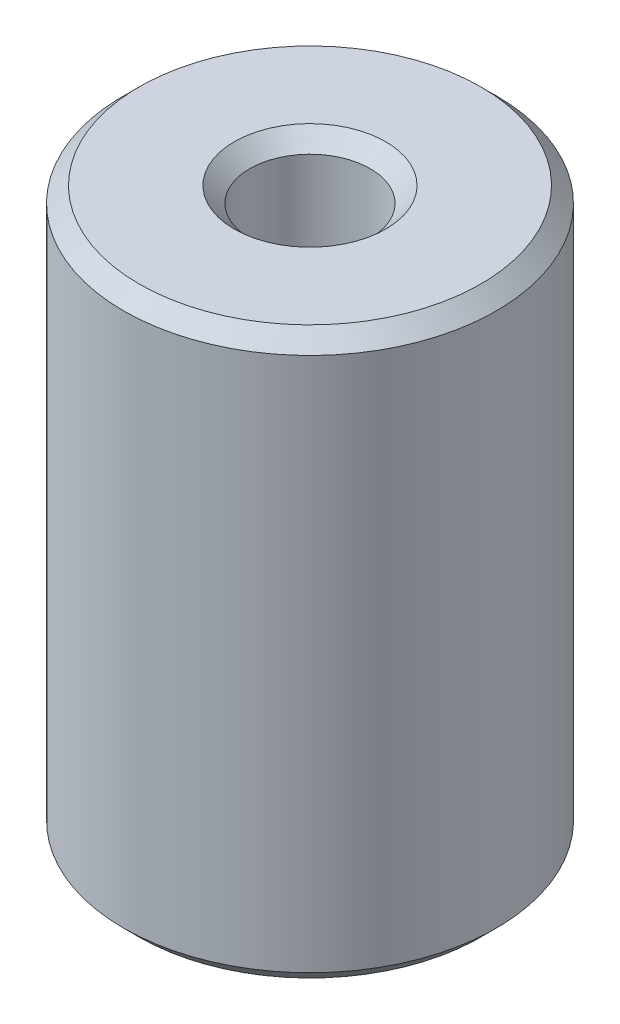
ISO-10303-21;
HEADER;
FILE_DESCRIPTION(('STEP AP214'),'2;1');
FILE_NAME('part.step','',(''),(''),'','','');
FILE_SCHEMA(('AUTOMOTIVE_DESIGN { 1 0 10303 214 1 1 1 1 }'));
ENDSEC;
DATA;
#1=APPLICATION_CONTEXT('core data for automotive mechanical design processes');
#2=APPLICATION_PROTOCOL_DEFINITION('international standard','automotive_design',2000,#1);
#3=PRODUCT_CONTEXT('',#1,'mechanical');
#4=PRODUCT('Part','Part','',(#3));
#5=PRODUCT_RELATED_PRODUCT_CATEGORY('part','',(#4));
#6=PRODUCT_DEFINITION_FORMATION('','',#4);
#7=PRODUCT_DEFINITION_CONTEXT('part definition',#1,'design');
#8=PRODUCT_DEFINITION('design','',#6,#7);
#9=PRODUCT_DEFINITION_SHAPE('','',#8);
#10=(LENGTH_UNIT() NAMED_UNIT(*) SI_UNIT(.MILLI.,.METRE.));
#11=(NAMED_UNIT(*) PLANE_ANGLE_UNIT() SI_UNIT($,.RADIAN.));
#12=(NAMED_UNIT(*) SI_UNIT($,.STERADIAN.) SOLID_ANGLE_UNIT());
#13=UNCERTAINTY_MEASURE_WITH_UNIT(LENGTH_MEASURE(1.E-05),#10,'distance_accuracy_value','');
#14=(GEOMETRIC_REPRESENTATION_CONTEXT(3) GLOBAL_UNCERTAINTY_ASSIGNED_CONTEXT((#13)) GLOBAL_UNIT_ASSIGNED_CONTEXT((#10,
#11,#12)) REPRESENTATION_CONTEXT('',''));
#15=CARTESIAN_POINT('',(0.,0.,0.));
#16=DIRECTION('',(0.,0.,1.));
#17=DIRECTION('',(1.,0.,0.));
#18=AXIS2_PLACEMENT_3D('',#15,#16,#17);
#19=CARTESIAN_POINT('',(0.,15.1792217421074,0.));
#20=DIRECTION('',(0.,-1.,0.));
#21=DIRECTION('',(0.,0.,-1.));
#22=AXIS2_PLACEMENT_3D('',#19,#20,#21);
#23=CYLINDRICAL_SURFACE('',#22,5.);
#24=CARTESIAN_POINT('',(0.,0.416594561890393,0.));
#25=DIRECTION('',(0.,1.,0.));
#26=DIRECTION('',(0.,0.,1.));
#27=AXIS2_PLACEMENT_3D('',#24,#25,#26);
#28=CIRCLE('',#27,5.);
#29=CARTESIAN_POINT('',(0.,0.416594561890393,5.));
#30=VERTEX_POINT('',#29);
#31=EDGE_CURVE('E10',#30,#30,#28,.T.);
#32=ORIENTED_EDGE('',*,*,#31,.T.);
#33=EDGE_LOOP('',(#32));
#34=FACE_BOUND('',#33,.T.);
#35=CARTESIAN_POINT('',(0.,14.762627180217,0.));
#36=DIRECTION('',(0.,1.,0.));
#37=DIRECTION('',(0.,0.,1.));
#38=AXIS2_PLACEMENT_3D('',#35,#36,#37);
#39=CIRCLE('',#38,5.);
#40=CARTESIAN_POINT('',(0.,14.762627180217,5.));
#41=VERTEX_POINT('',#40);
#42=EDGE_CURVE('E50',#41,#41,#39,.F.);
#43=ORIENTED_EDGE('',*,*,#42,.T.);
#44=EDGE_LOOP('',(#43));
#45=FACE_BOUND('',#44,.T.);
#46=ADVANCED_FACE('F39',(#34,#45),#23,.T.);
#47=CARTESIAN_POINT('',(0.,15.1792217421074,0.));
#48=DIRECTION('',(0.,1.,0.));
#49=DIRECTION('',(0.,0.,1.));
#50=AXIS2_PLACEMENT_3D('',#47,#48,#49);
#51=PLANE('',#50);
#52=CARTESIAN_POINT('',(0.,15.1792217421074,0.));
#53=DIRECTION('',(0.,1.,0.));
#54=DIRECTION('',(0.,0.,1.));
#55=AXIS2_PLACEMENT_3D('',#52,#53,#54);
#56=CIRCLE('',#55,2.03197839512757);
#57=CARTESIAN_POINT('',(0.,15.1792217421074,2.03197839512757));
#58=VERTEX_POINT('',#57);
#59=EDGE_CURVE('E58',#58,#58,#56,.F.);
#60=ORIENTED_EDGE('',*,*,#59,.T.);
#61=EDGE_LOOP('',(#60));
#62=FACE_BOUND('',#61,.T.);
#63=CARTESIAN_POINT('',(0.,15.1792217421074,0.));
#64=DIRECTION('',(0.,1.,0.));
#65=DIRECTION('',(0.,0.,1.));
#66=AXIS2_PLACEMENT_3D('',#63,#64,#65);
#67=CIRCLE('',#66,4.58340543810961);
#68=CARTESIAN_POINT('',(0.,15.1792217421074,4.58340543810961));
#69=VERTEX_POINT('',#68);
#70=EDGE_CURVE('E61',#69,#69,#67,.T.);
#71=ORIENTED_EDGE('',*,*,#70,.T.);
#72=EDGE_LOOP('',(#71));
#73=FACE_BOUND('',#72,.T.);
#74=ADVANCED_FACE('F88',(#62,#73),#51,.T.);
#75=CARTESIAN_POINT('',(0.,0.,0.));
#76=DIRECTION('',(0.,1.,0.));
#77=DIRECTION('',(0.,0.,1.));
#78=AXIS2_PLACEMENT_3D('',#75,#76,#77);
#79=PLANE('',#78);
#80=CARTESIAN_POINT('',(0.,0.,0.));
#81=DIRECTION('',(0.,1.,0.));
#82=DIRECTION('',(0.,0.,1.));
#83=AXIS2_PLACEMENT_3D('',#80,#81,#82);
#84=CIRCLE('',#83,2.03197839512757);
#85=CARTESIAN_POINT('',(0.,0.,2.03197839512757));
#86=VERTEX_POINT('',#85);
#87=EDGE_CURVE('E51',#86,#86,#84,.T.);
#88=ORIENTED_EDGE('',*,*,#87,.T.);
#89=EDGE_LOOP('',(#88));
#90=FACE_BOUND('',#89,.T.);
#91=CARTESIAN_POINT('',(0.,0.,0.));
#92=DIRECTION('',(0.,1.,0.));
#93=DIRECTION('',(0.,0.,1.));
#94=AXIS2_PLACEMENT_3D('',#91,#92,#93);
#95=CIRCLE('',#94,4.5834054381096);
#96=CARTESIAN_POINT('',(0.,0.,4.5834054381096));
#97=VERTEX_POINT('',#96);
#98=EDGE_CURVE('E54',#97,#97,#95,.F.);
#99=ORIENTED_EDGE('',*,*,#98,.T.);
#100=EDGE_LOOP('',(#99));
#101=FACE_BOUND('',#100,.T.);
#102=ADVANCED_FACE('F83',(#90,#101),#79,.F.);
#103=CARTESIAN_POINT('',(0.,15.1792217421074,0.));
#104=DIRECTION('',(0.,-1.,0.));
#105=DIRECTION('',(0.,0.,-1.));
#106=AXIS2_PLACEMENT_3D('',#103,#104,#105);
#107=CYLINDRICAL_SURFACE('',#106,1.61538383323717);
#108=CARTESIAN_POINT('',(0.,14.762627180217,0.));
#109=DIRECTION('',(0.,1.,0.));
#110=DIRECTION('',(0.,0.,1.));
#111=AXIS2_PLACEMENT_3D('',#108,#109,#110);
#112=CIRCLE('',#111,1.61538383323717);
#113=CARTESIAN_POINT('',(0.,14.762627180217,1.61538383323717));
#114=VERTEX_POINT('',#113);
#115=EDGE_CURVE('E67',#114,#114,#112,.T.);
#116=ORIENTED_EDGE('',*,*,#115,.T.);
#117=EDGE_LOOP('',(#116));
#118=FACE_BOUND('',#117,.T.);
#119=CARTESIAN_POINT('',(0.,0.416594561890396,0.));
#120=DIRECTION('',(0.,1.,0.));
#121=DIRECTION('',(0.,0.,1.));
#122=AXIS2_PLACEMENT_3D('',#119,#120,#121);
#123=CIRCLE('',#122,1.61538383323717);
#124=CARTESIAN_POINT('',(0.,0.416594561890396,1.61538383323717));
#125=VERTEX_POINT('',#124);
#126=EDGE_CURVE('E69',#125,#125,#123,.F.);
#127=ORIENTED_EDGE('',*,*,#126,.T.);
#128=EDGE_LOOP('',(#127));
#129=FACE_BOUND('',#128,.T.);
#130=ADVANCED_FACE('F71',(#118,#129),#107,.F.);
#131=CARTESIAN_POINT('',(0.,14.762627180217,0.));
#132=DIRECTION('',(0.,1.,0.));
#133=DIRECTION('',(0.,0.,1.));
#134=AXIS2_PLACEMENT_3D('',#131,#132,#133);
#135=CONICAL_SURFACE('',#134,1.61538383323717,0.785398163397453);
#136=ORIENTED_EDGE('',*,*,#59,.F.);
#137=EDGE_LOOP('',(#136));
#138=FACE_BOUND('',#137,.T.);
#139=ORIENTED_EDGE('',*,*,#115,.F.);
#140=EDGE_LOOP('',(#139));
#141=FACE_BOUND('',#140,.T.);
#142=ADVANCED_FACE('F77',(#138,#141),#135,.F.);
#143=CARTESIAN_POINT('',(0.,0.,0.));
#144=DIRECTION('',(0.,-1.,0.));
#145=DIRECTION('',(0.,0.,-1.));
#146=AXIS2_PLACEMENT_3D('',#143,#144,#145);
#147=CONICAL_SURFACE('',#146,2.03197839512757,0.785398163397445);
#148=ORIENTED_EDGE('',*,*,#126,.F.);
#149=EDGE_LOOP('',(#148));
#150=FACE_BOUND('',#149,.T.);
#151=ORIENTED_EDGE('',*,*,#87,.F.);
#152=EDGE_LOOP('',(#151));
#153=FACE_BOUND('',#152,.T.);
#154=ADVANCED_FACE('F73',(#150,#153),#147,.F.);
#155=CARTESIAN_POINT('',(0.,0.416594561890393,0.));
#156=DIRECTION('',(0.,1.,0.));
#157=DIRECTION('',(0.,0.,1.));
#158=AXIS2_PLACEMENT_3D('',#155,#156,#157);
#159=CONICAL_SURFACE('',#158,5.,0.785398163397456);
#160=ORIENTED_EDGE('',*,*,#98,.F.);
#161=EDGE_LOOP('',(#160));
#162=FACE_BOUND('',#161,.T.);
#163=ORIENTED_EDGE('',*,*,#31,.F.);
#164=EDGE_LOOP('',(#163));
#165=FACE_BOUND('',#164,.T.);
#166=ADVANCED_FACE('F76',(#162,#165),#159,.T.);
#167=CARTESIAN_POINT('',(0.,15.1792217421074,0.));
#168=DIRECTION('',(0.,-1.,0.));
#169=DIRECTION('',(0.,0.,-1.));
#170=AXIS2_PLACEMENT_3D('',#167,#168,#169);
#171=CONICAL_SURFACE('',#170,4.58340543810961,0.785398163397447);
#172=ORIENTED_EDGE('',*,*,#42,.F.);
#173=EDGE_LOOP('',(#172));
#174=FACE_BOUND('',#173,.T.);
#175=ORIENTED_EDGE('',*,*,#70,.F.);
#176=EDGE_LOOP('',(#175));
#177=FACE_BOUND('',#176,.T.);
#178=ADVANCED_FACE('F45',(#174,#177),#171,.T.);
#179=CLOSED_SHELL('',(#46,#74,#102,#130,#142,#154,#166,#178));
#180=MANIFOLD_SOLID_BREP('B2',#179);
#181=ADVANCED_BREP_SHAPE_REPRESENTATION('',(#18,#180),#14);
#182=SHAPE_DEFINITION_REPRESENTATION(#9,#181);
ENDSEC;
END-ISO-10303-21;
